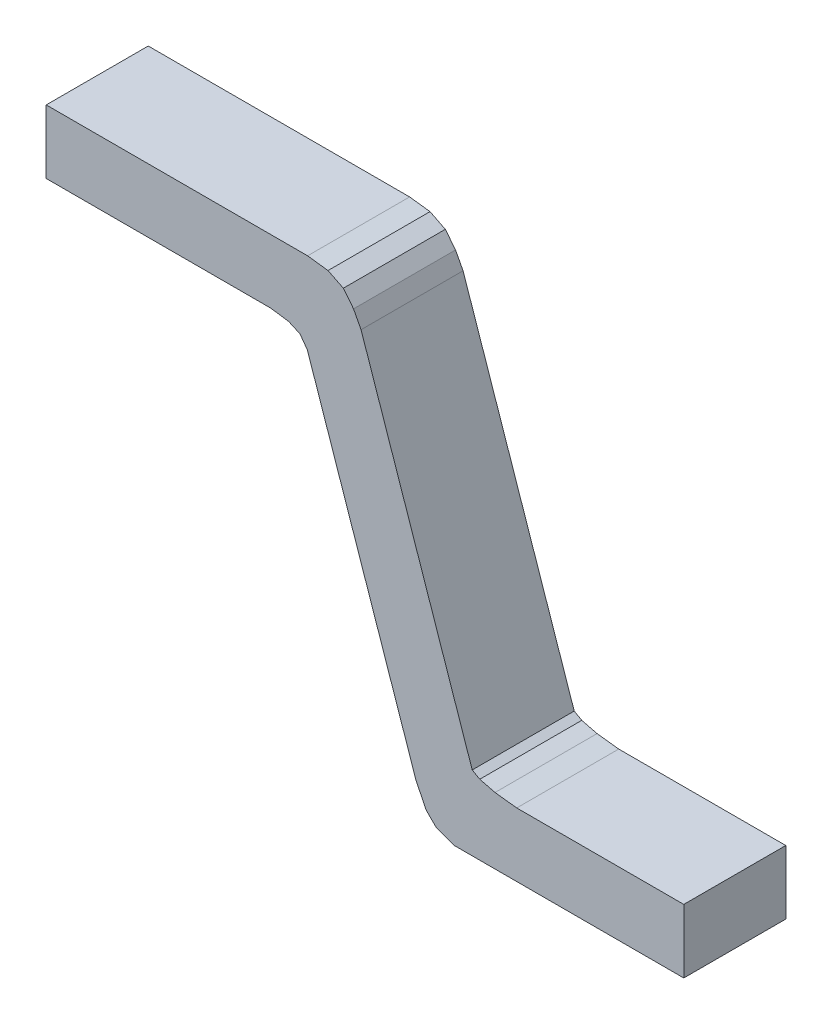
ISO-10303-21;
HEADER;
FILE_DESCRIPTION(('STEP AP214'),'2;1');
FILE_NAME('part.step','',(''),(''),'','','');
FILE_SCHEMA(('AUTOMOTIVE_DESIGN { 1 0 10303 214 1 1 1 1 }'));
ENDSEC;
DATA;
#1=APPLICATION_CONTEXT('core data for automotive mechanical design processes');
#2=APPLICATION_PROTOCOL_DEFINITION('international standard','automotive_design',2000,#1);
#3=PRODUCT_CONTEXT('',#1,'mechanical');
#4=PRODUCT('Part','Part','',(#3));
#5=PRODUCT_RELATED_PRODUCT_CATEGORY('part','',(#4));
#6=PRODUCT_DEFINITION_FORMATION('','',#4);
#7=PRODUCT_DEFINITION_CONTEXT('part definition',#1,'design');
#8=PRODUCT_DEFINITION('design','',#6,#7);
#9=PRODUCT_DEFINITION_SHAPE('','',#8);
#10=(LENGTH_UNIT() NAMED_UNIT(*) SI_UNIT(.MILLI.,.METRE.));
#11=(NAMED_UNIT(*) PLANE_ANGLE_UNIT() SI_UNIT($,.RADIAN.));
#12=(NAMED_UNIT(*) SI_UNIT($,.STERADIAN.) SOLID_ANGLE_UNIT());
#13=UNCERTAINTY_MEASURE_WITH_UNIT(LENGTH_MEASURE(1.E-05),#10,'distance_accuracy_value','');
#14=(GEOMETRIC_REPRESENTATION_CONTEXT(3) GLOBAL_UNCERTAINTY_ASSIGNED_CONTEXT((#13)) GLOBAL_UNIT_ASSIGNED_CONTEXT((#10,
#11,#12)) REPRESENTATION_CONTEXT('',''));
#15=CARTESIAN_POINT('',(0.,0.,0.));
#16=DIRECTION('',(0.,0.,1.));
#17=DIRECTION('',(1.,0.,0.));
#18=AXIS2_PLACEMENT_3D('',#15,#16,#17);
#19=CARTESIAN_POINT('',(2.50000008,-1.71500038,0.8));
#20=DIRECTION('',(0.,0.,1.));
#21=DIRECTION('',(1.,0.,0.));
#22=AXIS2_PLACEMENT_3D('',#19,#20,#21);
#23=PLANE('',#22);
#24=DIRECTION('',(0.440656785319311,-0.897675663896516,0.));
#25=VECTOR('',#24,1.);
#26=CARTESIAN_POINT('',(0.40003222,-1.42209774,0.8));
#27=LINE('',#26,#25);
#28=CARTESIAN_POINT('',(0.400032220000027,-1.42209774000001,0.8));
#29=VERTEX_POINT('',#28);
#30=CARTESIAN_POINT('',(0.47999904,-1.58500064,0.8));
#31=VERTEX_POINT('',#30);
#32=EDGE_CURVE('E157',#29,#31,#27,.T.);
#33=ORIENTED_EDGE('',*,*,#32,.T.);
#34=DIRECTION('',(0.707106781186547,-0.707106781186547,0.));
#35=VECTOR('',#34,1.);
#36=CARTESIAN_POINT('',(0.47999904,-1.58500064,0.8));
#37=LINE('',#36,#35);
#38=CARTESIAN_POINT('',(0.559998880000002,-1.66500048,0.8));
#39=VERTEX_POINT('',#38);
#40=EDGE_CURVE('E160',#31,#39,#37,.T.);
#41=ORIENTED_EDGE('',*,*,#40,.T.);
#42=DIRECTION('',(0.941743844344924,-0.336330985248821,0.));
#43=VECTOR('',#42,1.);
#44=CARTESIAN_POINT('',(0.55999888,-1.66500048,0.8));
#45=LINE('',#44,#43);
#46=CARTESIAN_POINT('',(0.70000114,-1.71500038,0.8));
#47=VERTEX_POINT('',#46);
#48=EDGE_CURVE('E20',#39,#47,#45,.T.);
#49=ORIENTED_EDGE('',*,*,#48,.T.);
#50=DIRECTION('',(1.,0.,0.));
#51=VECTOR('',#50,1.);
#52=CARTESIAN_POINT('',(2.50000008,-1.71500038,0.8));
#53=LINE('',#52,#51);
#54=CARTESIAN_POINT('',(2.50000008,-1.71500038,0.8));
#55=VERTEX_POINT('',#54);
#56=EDGE_CURVE('E163',#55,#47,#53,.F.);
#57=ORIENTED_EDGE('',*,*,#56,.F.);
#58=DIRECTION('',(0.,1.,0.));
#59=VECTOR('',#58,1.);
#60=CARTESIAN_POINT('',(2.50000008,-1.21500138,0.8));
#61=LINE('',#60,#59);
#62=CARTESIAN_POINT('',(2.50000008,-1.21500138,0.8));
#63=VERTEX_POINT('',#62);
#64=EDGE_CURVE('E178',#63,#55,#61,.F.);
#65=ORIENTED_EDGE('',*,*,#64,.F.);
#66=DIRECTION('',(1.,0.,0.));
#67=VECTOR('',#66,1.);
#68=CARTESIAN_POINT('',(1.19000016,-1.21500138,0.8));
#69=LINE('',#68,#67);
#70=CARTESIAN_POINT('',(1.19000016,-1.21500137999998,0.8));
#71=VERTEX_POINT('',#70);
#72=EDGE_CURVE('E183',#71,#63,#69,.T.);
#73=ORIENTED_EDGE('',*,*,#72,.F.);
#74=DIRECTION('',(-0.993150604322924,0.116841247566991,0.));
#75=VECTOR('',#74,1.);
#76=CARTESIAN_POINT('',(1.0200005,-1.19500142,0.8));
#77=LINE('',#76,#75);
#78=CARTESIAN_POINT('',(1.0200005,-1.19500141999999,0.8));
#79=VERTEX_POINT('',#78);
#80=EDGE_CURVE('E188',#79,#71,#77,.F.);
#81=ORIENTED_EDGE('',*,*,#80,.F.);
#82=DIRECTION('',(-0.970142500145391,0.242535625036098,0.));
#83=VECTOR('',#82,1.);
#84=CARTESIAN_POINT('',(0.90000074,-1.16500148,0.8));
#85=LINE('',#84,#83);
#86=CARTESIAN_POINT('',(0.90000074,-1.16500148,0.8));
#87=VERTEX_POINT('',#86);
#88=EDGE_CURVE('E193',#87,#79,#85,.F.);
#89=ORIENTED_EDGE('',*,*,#88,.F.);
#90=DIRECTION('',(-0.870381726372608,0.492377548631778,0.));
#91=VECTOR('',#90,1.);
#92=CARTESIAN_POINT('',(0.84087208,-1.13155222,0.8));
#93=LINE('',#92,#91);
#94=CARTESIAN_POINT('',(0.840872080000308,-1.1315522199999,0.8));
#95=VERTEX_POINT('',#94);
#96=EDGE_CURVE('E198',#95,#87,#93,.F.);
#97=ORIENTED_EDGE('',*,*,#96,.F.);
#98=DIRECTION('',(-0.323001701829079,0.946398383671231,0.));
#99=VECTOR('',#98,1.);
#100=CARTESIAN_POINT('',(-0.03091434000001,1.42279116,0.8));
#101=LINE('',#100,#99);
#102=CARTESIAN_POINT('',(-0.0309143400000312,1.42279116,0.8));
#103=VERTEX_POINT('',#102);
#104=EDGE_CURVE('E203',#103,#95,#101,.F.);
#105=ORIENTED_EDGE('',*,*,#104,.F.);
#106=DIRECTION('',(-0.465918127334981,0.884827835581965,0.));
#107=VECTOR('',#106,1.);
#108=CARTESIAN_POINT('',(-0.08999982,1.53500074,0.8));
#109=LINE('',#108,#107);
#110=CARTESIAN_POINT('',(-0.0899998200000124,1.53500074,0.8));
#111=VERTEX_POINT('',#110);
#112=EDGE_CURVE('E208',#111,#103,#109,.F.);
#113=ORIENTED_EDGE('',*,*,#112,.F.);
#114=DIRECTION('',(-0.62469504755418,0.780868809443225,0.));
#115=VECTOR('',#114,1.);
#116=CARTESIAN_POINT('',(-0.16999966,1.63500054,0.8));
#117=LINE('',#116,#115);
#118=CARTESIAN_POINT('',(-0.16999966,1.63500054,0.8));
#119=VERTEX_POINT('',#118);
#120=EDGE_CURVE('E213',#119,#111,#117,.F.);
#121=ORIENTED_EDGE('',*,*,#120,.F.);
#122=DIRECTION('',(-0.894427190999916,0.447213595499958,0.));
#123=VECTOR('',#122,1.);
#124=CARTESIAN_POINT('',(-0.28999942,1.69500042,0.8));
#125=LINE('',#124,#123);
#126=CARTESIAN_POINT('',(-0.289999419999999,1.69500042000001,0.8));
#127=VERTEX_POINT('',#126);
#128=EDGE_CURVE('E218',#127,#119,#125,.F.);
#129=ORIENTED_EDGE('',*,*,#128,.F.);
#130=DIRECTION('',(-0.992277876713698,0.124034734588962,0.));
#131=VECTOR('',#130,1.);
#132=CARTESIAN_POINT('',(-0.4499991,1.71500038,0.8));
#133=LINE('',#132,#131);
#134=CARTESIAN_POINT('',(-0.449999100000001,1.71500038,0.8));
#135=VERTEX_POINT('',#134);
#136=EDGE_CURVE('E223',#135,#127,#133,.F.);
#137=ORIENTED_EDGE('',*,*,#136,.F.);
#138=DIRECTION('',(1.,0.,0.));
#139=VECTOR('',#138,1.);
#140=CARTESIAN_POINT('',(-2.50000008,1.71500038,0.8));
#141=LINE('',#140,#139);
#142=CARTESIAN_POINT('',(-2.50000008,1.71500038,0.8));
#143=VERTEX_POINT('',#142);
#144=EDGE_CURVE('E228',#143,#135,#141,.T.);
#145=ORIENTED_EDGE('',*,*,#144,.F.);
#146=DIRECTION('',(0.,1.,0.));
#147=VECTOR('',#146,1.);
#148=CARTESIAN_POINT('',(-2.50000008,1.21499884,0.8));
#149=LINE('',#148,#147);
#150=CARTESIAN_POINT('',(-2.50000008,1.21499884,0.8));
#151=VERTEX_POINT('',#150);
#152=EDGE_CURVE('E233',#151,#143,#149,.T.);
#153=ORIENTED_EDGE('',*,*,#152,.F.);
#154=DIRECTION('',(1.,0.,0.));
#155=VECTOR('',#154,1.);
#156=CARTESIAN_POINT('',(-0.74000106,1.21499884,0.8));
#157=LINE('',#156,#155);
#158=CARTESIAN_POINT('',(-0.740001059999987,1.21499883999999,0.8));
#159=VERTEX_POINT('',#158);
#160=EDGE_CURVE('E238',#159,#151,#157,.F.);
#161=ORIENTED_EDGE('',*,*,#160,.F.);
#162=DIRECTION('',(0.989949493661207,-0.14142135623703,0.));
#163=VECTOR('',#162,1.);
#164=CARTESIAN_POINT('',(-0.60000134,1.19499888,0.8));
#165=LINE('',#164,#163);
#166=CARTESIAN_POINT('',(-0.600001340000002,1.19499887999999,0.8));
#167=VERTEX_POINT('',#166);
#168=EDGE_CURVE('E243',#167,#159,#165,.F.);
#169=ORIENTED_EDGE('',*,*,#168,.F.);
#170=DIRECTION('',(0.913815802464895,-0.406128894767953,0.));
#171=VECTOR('',#170,1.);
#172=CARTESIAN_POINT('',(-0.50999898,1.15499896,0.8));
#173=LINE('',#172,#171);
#174=CARTESIAN_POINT('',(-0.509998980000004,1.15499896,0.8));
#175=VERTEX_POINT('',#174);
#176=EDGE_CURVE('E248',#175,#167,#173,.F.);
#177=ORIENTED_EDGE('',*,*,#176,.F.);
#178=DIRECTION('',(0.586066820389869,-0.810262724082818,0.));
#179=VECTOR('',#178,1.);
#180=CARTESIAN_POINT('',(-0.45229272,1.07521756,0.8));
#181=LINE('',#180,#179);
#182=CARTESIAN_POINT('',(-0.45229271999988,1.07521756000004,0.8));
#183=VERTEX_POINT('',#182);
#184=EDGE_CURVE('E253',#183,#175,#181,.F.);
#185=ORIENTED_EDGE('',*,*,#184,.F.);
#186=DIRECTION('',(0.323002366654921,-0.946398156768767,0.));
#187=VECTOR('',#186,1.);
#188=CARTESIAN_POINT('',(0.40003222,-1.42209774,0.8));
#189=LINE('',#188,#187);
#190=EDGE_CURVE('E258',#29,#183,#189,.F.);
#191=ORIENTED_EDGE('',*,*,#190,.F.);
#192=EDGE_LOOP('',(#33,#41,#49,#57,#65,#73,#81,#89,#97,#105,#113,#121,#129,#137,#145,#153,#161,
#169,#177,#185,#191));
#193=FACE_BOUND('',#192,.T.);
#194=ADVANCED_FACE('F17',(#193),#23,.T.);
#195=CARTESIAN_POINT('',(2.50000008,-1.71500038,0.));
#196=DIRECTION('',(0.,-1.,0.));
#197=DIRECTION('',(0.,0.,-1.));
#198=AXIS2_PLACEMENT_3D('',#195,#196,#197);
#199=PLANE('',#198);
#200=DIRECTION('',(0.,0.,-1.));
#201=VECTOR('',#200,1.);
#202=CARTESIAN_POINT('',(2.50000008,-1.71500038,0.));
#203=LINE('',#202,#201);
#204=CARTESIAN_POINT('',(2.50000008,-1.71500038,0.));
#205=VERTEX_POINT('',#204);
#206=EDGE_CURVE('E176',#55,#205,#203,.T.);
#207=ORIENTED_EDGE('',*,*,#206,.F.);
#208=ORIENTED_EDGE('',*,*,#56,.T.);
#209=DIRECTION('',(0.,0.,1.));
#210=VECTOR('',#209,1.);
#211=CARTESIAN_POINT('',(0.70000114,-1.71500038,0.));
#212=LINE('',#211,#210);
#213=CARTESIAN_POINT('',(0.700001140000001,-1.71500038,0.));
#214=VERTEX_POINT('',#213);
#215=EDGE_CURVE('E168',#214,#47,#212,.T.);
#216=ORIENTED_EDGE('',*,*,#215,.F.);
#217=DIRECTION('',(1.,0.,0.));
#218=VECTOR('',#217,1.);
#219=CARTESIAN_POINT('',(2.50000008,-1.71500038,0.));
#220=LINE('',#219,#218);
#221=EDGE_CURVE('E265',#214,#205,#220,.T.);
#222=ORIENTED_EDGE('',*,*,#221,.T.);
#223=EDGE_LOOP('',(#207,#208,#216,#222));
#224=FACE_BOUND('',#223,.T.);
#225=ADVANCED_FACE('F397',(#224),#199,.T.);
#226=CARTESIAN_POINT('',(2.50000008,-1.21500138,0.));
#227=DIRECTION('',(1.,0.,0.));
#228=DIRECTION('',(0.,0.,-1.));
#229=AXIS2_PLACEMENT_3D('',#226,#227,#228);
#230=PLANE('',#229);
#231=DIRECTION('',(0.,0.,1.));
#232=VECTOR('',#231,1.);
#233=CARTESIAN_POINT('',(2.50000008,-1.21500138,0.));
#234=LINE('',#233,#232);
#235=CARTESIAN_POINT('',(2.50000008,-1.21500138,0.));
#236=VERTEX_POINT('',#235);
#237=EDGE_CURVE('E181',#63,#236,#234,.F.);
#238=ORIENTED_EDGE('',*,*,#237,.F.);
#239=ORIENTED_EDGE('',*,*,#64,.T.);
#240=ORIENTED_EDGE('',*,*,#206,.T.);
#241=DIRECTION('',(0.,1.,0.));
#242=VECTOR('',#241,1.);
#243=CARTESIAN_POINT('',(2.50000008,-1.71500038,0.));
#244=LINE('',#243,#242);
#245=EDGE_CURVE('E268',#205,#236,#244,.T.);
#246=ORIENTED_EDGE('',*,*,#245,.T.);
#247=EDGE_LOOP('',(#238,#239,#240,#246));
#248=FACE_BOUND('',#247,.T.);
#249=ADVANCED_FACE('F394',(#248),#230,.T.);
#250=CARTESIAN_POINT('',(1.19000016,-1.21500138,0.));
#251=DIRECTION('',(0.,1.,0.));
#252=DIRECTION('',(0.,0.,1.));
#253=AXIS2_PLACEMENT_3D('',#250,#251,#252);
#254=PLANE('',#253);
#255=DIRECTION('',(0.,0.,1.));
#256=VECTOR('',#255,1.);
#257=CARTESIAN_POINT('',(1.19000016000001,-1.21500137999993,0.));
#258=LINE('',#257,#256);
#259=CARTESIAN_POINT('',(1.19000016,-1.21500137999998,0.));
#260=VERTEX_POINT('',#259);
#261=EDGE_CURVE('E186',#71,#260,#258,.F.);
#262=ORIENTED_EDGE('',*,*,#261,.F.);
#263=ORIENTED_EDGE('',*,*,#72,.T.);
#264=ORIENTED_EDGE('',*,*,#237,.T.);
#265=DIRECTION('',(1.,0.,0.));
#266=VECTOR('',#265,1.);
#267=CARTESIAN_POINT('',(2.50000008,-1.21500138,0.));
#268=LINE('',#267,#266);
#269=EDGE_CURVE('E271',#236,#260,#268,.F.);
#270=ORIENTED_EDGE('',*,*,#269,.T.);
#271=EDGE_LOOP('',(#262,#263,#264,#270));
#272=FACE_BOUND('',#271,.T.);
#273=ADVANCED_FACE('F390',(#272),#254,.T.);
#274=CARTESIAN_POINT('',(1.0200005,-1.19500142,0.));
#275=DIRECTION('',(0.116841247566991,0.993150604322924,0.));
#276=DIRECTION('',(-0.993150604322924,0.116841247566991,0.));
#277=AXIS2_PLACEMENT_3D('',#274,#275,#276);
#278=PLANE('',#277);
#279=DIRECTION('',(0.,0.,1.));
#280=VECTOR('',#279,1.);
#281=CARTESIAN_POINT('',(1.02000050000001,-1.19500141999997,0.));
#282=LINE('',#281,#280);
#283=CARTESIAN_POINT('',(1.0200005,-1.19500141999999,0.));
#284=VERTEX_POINT('',#283);
#285=EDGE_CURVE('E191',#79,#284,#282,.F.);
#286=ORIENTED_EDGE('',*,*,#285,.F.);
#287=ORIENTED_EDGE('',*,*,#80,.T.);
#288=ORIENTED_EDGE('',*,*,#261,.T.);
#289=DIRECTION('',(-0.993150604322876,0.116841247567396,0.));
#290=VECTOR('',#289,1.);
#291=CARTESIAN_POINT('',(1.19000016,-1.21500138,0.));
#292=LINE('',#291,#290);
#293=EDGE_CURVE('E274',#260,#284,#292,.T.);
#294=ORIENTED_EDGE('',*,*,#293,.T.);
#295=EDGE_LOOP('',(#286,#287,#288,#294));
#296=FACE_BOUND('',#295,.T.);
#297=ADVANCED_FACE('F387',(#296),#278,.T.);
#298=CARTESIAN_POINT('',(0.90000074,-1.16500148,0.));
#299=DIRECTION('',(0.242535625036098,0.970142500145391,0.));
#300=DIRECTION('',(-0.970142500145391,0.242535625036098,0.));
#301=AXIS2_PLACEMENT_3D('',#298,#299,#300);
#302=PLANE('',#301);
#303=DIRECTION('',(0.,0.,1.));
#304=VECTOR('',#303,1.);
#305=CARTESIAN_POINT('',(0.900000740000002,-1.16500148,0.));
#306=LINE('',#305,#304);
#307=CARTESIAN_POINT('',(0.90000074,-1.16500148,0.));
#308=VERTEX_POINT('',#307);
#309=EDGE_CURVE('E196',#87,#308,#306,.F.);
#310=ORIENTED_EDGE('',*,*,#309,.F.);
#311=ORIENTED_EDGE('',*,*,#88,.T.);
#312=ORIENTED_EDGE('',*,*,#285,.T.);
#313=DIRECTION('',(-0.970142500145332,0.242535625036333,0.));
#314=VECTOR('',#313,1.);
#315=CARTESIAN_POINT('',(1.0200005,-1.19500142,0.));
#316=LINE('',#315,#314);
#317=EDGE_CURVE('E277',#284,#308,#316,.T.);
#318=ORIENTED_EDGE('',*,*,#317,.T.);
#319=EDGE_LOOP('',(#310,#311,#312,#318));
#320=FACE_BOUND('',#319,.T.);
#321=ADVANCED_FACE('F382',(#320),#302,.T.);
#322=CARTESIAN_POINT('',(0.84087208,-1.13155222,0.));
#323=DIRECTION('',(0.492377548631778,0.870381726372608,0.));
#324=DIRECTION('',(-0.870381726372608,0.492377548631778,0.));
#325=AXIS2_PLACEMENT_3D('',#322,#323,#324);
#326=PLANE('',#325);
#327=DIRECTION('',(0.,0.,1.));
#328=VECTOR('',#327,1.);
#329=CARTESIAN_POINT('',(0.840872080001234,-1.13155221999958,0.));
#330=LINE('',#329,#328);
#331=CARTESIAN_POINT('',(0.840872080000308,-1.1315522199999,0.));
#332=VERTEX_POINT('',#331);
#333=EDGE_CURVE('E201',#95,#332,#330,.F.);
#334=ORIENTED_EDGE('',*,*,#333,.F.);
#335=ORIENTED_EDGE('',*,*,#96,.T.);
#336=ORIENTED_EDGE('',*,*,#309,.T.);
#337=DIRECTION('',(-0.870381726372576,0.492377548631834,0.));
#338=VECTOR('',#337,1.);
#339=CARTESIAN_POINT('',(0.90000074,-1.16500148,0.));
#340=LINE('',#339,#338);
#341=EDGE_CURVE('E280',#308,#332,#340,.T.);
#342=ORIENTED_EDGE('',*,*,#341,.T.);
#343=EDGE_LOOP('',(#334,#335,#336,#342));
#344=FACE_BOUND('',#343,.T.);
#345=ADVANCED_FACE('F379',(#344),#326,.T.);
#346=CARTESIAN_POINT('',(-0.03091434000001,1.42279116,0.));
#347=DIRECTION('',(0.946398383671231,0.323001701829079,0.));
#348=DIRECTION('',(-0.323001701829079,0.946398383671231,0.));
#349=AXIS2_PLACEMENT_3D('',#346,#347,#348);
#350=PLANE('',#349);
#351=DIRECTION('',(0.,0.,1.));
#352=VECTOR('',#351,1.);
#353=CARTESIAN_POINT('',(-0.0309143400000743,1.42279115999998,0.));
#354=LINE('',#353,#352);
#355=CARTESIAN_POINT('',(-0.0309143400000312,1.42279116,0.));
#356=VERTEX_POINT('',#355);
#357=EDGE_CURVE('E206',#103,#356,#354,.F.);
#358=ORIENTED_EDGE('',*,*,#357,.F.);
#359=ORIENTED_EDGE('',*,*,#104,.T.);
#360=ORIENTED_EDGE('',*,*,#333,.T.);
#361=DIRECTION('',(-0.323001701828629,0.946398383671385,0.));
#362=VECTOR('',#361,1.);
#363=CARTESIAN_POINT('',(0.84087208,-1.13155222,0.));
#364=LINE('',#363,#362);
#365=EDGE_CURVE('E283',#332,#356,#364,.T.);
#366=ORIENTED_EDGE('',*,*,#365,.T.);
#367=EDGE_LOOP('',(#358,#359,#360,#366));
#368=FACE_BOUND('',#367,.T.);
#369=ADVANCED_FACE('F374',(#368),#350,.T.);
#370=CARTESIAN_POINT('',(-0.08999982,1.53500074,0.));
#371=DIRECTION('',(0.884827835581965,0.465918127334981,0.));
#372=DIRECTION('',(-0.465918127334981,0.884827835581965,0.));
#373=AXIS2_PLACEMENT_3D('',#370,#371,#372);
#374=PLANE('',#373);
#375=DIRECTION('',(0.,0.,1.));
#376=VECTOR('',#375,1.);
#377=CARTESIAN_POINT('',(-0.0899998200000351,1.53500073999998,0.));
#378=LINE('',#377,#376);
#379=CARTESIAN_POINT('',(-0.0899998200000124,1.53500074,0.));
#380=VERTEX_POINT('',#379);
#381=EDGE_CURVE('E211',#111,#380,#378,.F.);
#382=ORIENTED_EDGE('',*,*,#381,.F.);
#383=ORIENTED_EDGE('',*,*,#112,.T.);
#384=ORIENTED_EDGE('',*,*,#357,.T.);
#385=DIRECTION('',(-0.465918127335394,0.884827835581747,0.));
#386=VECTOR('',#385,1.);
#387=CARTESIAN_POINT('',(-0.0309143400000298,1.42279116,0.));
#388=LINE('',#387,#386);
#389=EDGE_CURVE('E286',#356,#380,#388,.T.);
#390=ORIENTED_EDGE('',*,*,#389,.T.);
#391=EDGE_LOOP('',(#382,#383,#384,#390));
#392=FACE_BOUND('',#391,.T.);
#393=ADVANCED_FACE('F371',(#392),#374,.T.);
#394=CARTESIAN_POINT('',(-0.16999966,1.63500054,0.));
#395=DIRECTION('',(0.780868809443225,0.62469504755418,0.));
#396=DIRECTION('',(-0.62469504755418,0.780868809443225,0.));
#397=AXIS2_PLACEMENT_3D('',#394,#395,#396);
#398=PLANE('',#397);
#399=DIRECTION('',(0.,0.,1.));
#400=VECTOR('',#399,1.);
#401=CARTESIAN_POINT('',(-0.16999966,1.63500054,0.));
#402=LINE('',#401,#400);
#403=CARTESIAN_POINT('',(-0.16999966,1.63500054,0.));
#404=VERTEX_POINT('',#403);
#405=EDGE_CURVE('E216',#119,#404,#402,.F.);
#406=ORIENTED_EDGE('',*,*,#405,.F.);
#407=ORIENTED_EDGE('',*,*,#120,.T.);
#408=ORIENTED_EDGE('',*,*,#381,.T.);
#409=DIRECTION('',(-0.624695047554376,0.780868809443069,0.));
#410=VECTOR('',#409,1.);
#411=CARTESIAN_POINT('',(-0.0899998200000101,1.53500074,0.));
#412=LINE('',#411,#410);
#413=EDGE_CURVE('E289',#380,#404,#412,.T.);
#414=ORIENTED_EDGE('',*,*,#413,.T.);
#415=EDGE_LOOP('',(#406,#407,#408,#414));
#416=FACE_BOUND('',#415,.T.);
#417=ADVANCED_FACE('F366',(#416),#398,.T.);
#418=CARTESIAN_POINT('',(-0.28999942,1.69500042,0.));
#419=DIRECTION('',(0.447213595499958,0.894427190999916,0.));
#420=DIRECTION('',(-0.894427190999916,0.447213595499958,0.));
#421=AXIS2_PLACEMENT_3D('',#418,#419,#420);
#422=PLANE('',#421);
#423=DIRECTION('',(0.,0.,1.));
#424=VECTOR('',#423,1.);
#425=CARTESIAN_POINT('',(-0.289999419999995,1.69500042000004,0.));
#426=LINE('',#425,#424);
#427=CARTESIAN_POINT('',(-0.289999419999999,1.69500042000001,0.));
#428=VERTEX_POINT('',#427);
#429=EDGE_CURVE('E221',#127,#428,#426,.F.);
#430=ORIENTED_EDGE('',*,*,#429,.F.);
#431=ORIENTED_EDGE('',*,*,#128,.T.);
#432=ORIENTED_EDGE('',*,*,#405,.T.);
#433=DIRECTION('',(-0.894427190999917,0.447213595499957,0.));
#434=VECTOR('',#433,1.);
#435=CARTESIAN_POINT('',(-0.16999966,1.63500054,0.));
#436=LINE('',#435,#434);
#437=EDGE_CURVE('E292',#404,#428,#436,.T.);
#438=ORIENTED_EDGE('',*,*,#437,.T.);
#439=EDGE_LOOP('',(#430,#431,#432,#438));
#440=FACE_BOUND('',#439,.T.);
#441=ADVANCED_FACE('F363',(#440),#422,.T.);
#442=CARTESIAN_POINT('',(-0.4499991,1.71500038,0.));
#443=DIRECTION('',(0.124034734588962,0.992277876713698,0.));
#444=DIRECTION('',(-0.992277876713698,0.124034734588962,0.));
#445=AXIS2_PLACEMENT_3D('',#442,#443,#444);
#446=PLANE('',#445);
#447=DIRECTION('',(0.,0.,1.));
#448=VECTOR('',#447,1.);
#449=CARTESIAN_POINT('',(-0.4499991,1.71500038,0.));
#450=LINE('',#449,#448);
#451=CARTESIAN_POINT('',(-0.449999100000001,1.71500038,0.));
#452=VERTEX_POINT('',#451);
#453=EDGE_CURVE('E226',#135,#452,#450,.F.);
#454=ORIENTED_EDGE('',*,*,#453,.F.);
#455=ORIENTED_EDGE('',*,*,#136,.T.);
#456=ORIENTED_EDGE('',*,*,#429,.T.);
#457=DIRECTION('',(-0.992277876713668,0.124034734589207,0.));
#458=VECTOR('',#457,1.);
#459=CARTESIAN_POINT('',(-0.28999942,1.69500042,0.));
#460=LINE('',#459,#458);
#461=EDGE_CURVE('E295',#428,#452,#460,.T.);
#462=ORIENTED_EDGE('',*,*,#461,.T.);
#463=EDGE_LOOP('',(#454,#455,#456,#462));
#464=FACE_BOUND('',#463,.T.);
#465=ADVANCED_FACE('F358',(#464),#446,.T.);
#466=CARTESIAN_POINT('',(-2.50000008,1.71500038,0.));
#467=DIRECTION('',(0.,1.,0.));
#468=DIRECTION('',(0.,0.,1.));
#469=AXIS2_PLACEMENT_3D('',#466,#467,#468);
#470=PLANE('',#469);
#471=DIRECTION('',(0.,0.,1.));
#472=VECTOR('',#471,1.);
#473=CARTESIAN_POINT('',(-2.50000008,1.71500038,0.));
#474=LINE('',#473,#472);
#475=CARTESIAN_POINT('',(-2.50000008,1.71500038,0.));
#476=VERTEX_POINT('',#475);
#477=EDGE_CURVE('E231',#143,#476,#474,.F.);
#478=ORIENTED_EDGE('',*,*,#477,.F.);
#479=ORIENTED_EDGE('',*,*,#144,.T.);
#480=ORIENTED_EDGE('',*,*,#453,.T.);
#481=DIRECTION('',(1.,0.,0.));
#482=VECTOR('',#481,1.);
#483=CARTESIAN_POINT('',(2.50000008,1.71500038,0.));
#484=LINE('',#483,#482);
#485=EDGE_CURVE('E298',#452,#476,#484,.F.);
#486=ORIENTED_EDGE('',*,*,#485,.T.);
#487=EDGE_LOOP('',(#478,#479,#480,#486));
#488=FACE_BOUND('',#487,.T.);
#489=ADVANCED_FACE('F355',(#488),#470,.T.);
#490=CARTESIAN_POINT('',(-2.50000008,1.21499884,0.));
#491=DIRECTION('',(-1.,0.,0.));
#492=DIRECTION('',(0.,0.,1.));
#493=AXIS2_PLACEMENT_3D('',#490,#491,#492);
#494=PLANE('',#493);
#495=DIRECTION('',(0.,0.,-1.));
#496=VECTOR('',#495,1.);
#497=CARTESIAN_POINT('',(-2.50000008,1.21499884,0.));
#498=LINE('',#497,#496);
#499=CARTESIAN_POINT('',(-2.50000008,1.21499884,0.));
#500=VERTEX_POINT('',#499);
#501=EDGE_CURVE('E236',#151,#500,#498,.T.);
#502=ORIENTED_EDGE('',*,*,#501,.F.);
#503=ORIENTED_EDGE('',*,*,#152,.T.);
#504=ORIENTED_EDGE('',*,*,#477,.T.);
#505=DIRECTION('',(0.,1.,0.));
#506=VECTOR('',#505,1.);
#507=CARTESIAN_POINT('',(-2.50000008,-1.71500038,0.));
#508=LINE('',#507,#506);
#509=EDGE_CURVE('E301',#476,#500,#508,.F.);
#510=ORIENTED_EDGE('',*,*,#509,.T.);
#511=EDGE_LOOP('',(#502,#503,#504,#510));
#512=FACE_BOUND('',#511,.T.);
#513=ADVANCED_FACE('F350',(#512),#494,.T.);
#514=CARTESIAN_POINT('',(-0.74000106,1.21499884,0.));
#515=DIRECTION('',(0.,-1.,0.));
#516=DIRECTION('',(0.,0.,-1.));
#517=AXIS2_PLACEMENT_3D('',#514,#515,#516);
#518=PLANE('',#517);
#519=DIRECTION('',(0.,0.,1.));
#520=VECTOR('',#519,1.);
#521=CARTESIAN_POINT('',(-0.740001060000006,1.21499883999996,0.));
#522=LINE('',#521,#520);
#523=CARTESIAN_POINT('',(-0.740001059999987,1.21499883999999,0.));
#524=VERTEX_POINT('',#523);
#525=EDGE_CURVE('E241',#159,#524,#522,.F.);
#526=ORIENTED_EDGE('',*,*,#525,.F.);
#527=ORIENTED_EDGE('',*,*,#160,.T.);
#528=ORIENTED_EDGE('',*,*,#501,.T.);
#529=DIRECTION('',(1.,0.,0.));
#530=VECTOR('',#529,1.);
#531=CARTESIAN_POINT('',(2.50000008,1.21499884,0.));
#532=LINE('',#531,#530);
#533=EDGE_CURVE('E304',#500,#524,#532,.T.);
#534=ORIENTED_EDGE('',*,*,#533,.T.);
#535=EDGE_LOOP('',(#526,#527,#528,#534));
#536=FACE_BOUND('',#535,.T.);
#537=ADVANCED_FACE('F347',(#536),#518,.T.);
#538=CARTESIAN_POINT('',(-0.60000134,1.19499888,0.));
#539=DIRECTION('',(-0.14142135623703,-0.989949493661207,0.));
#540=DIRECTION('',(0.989949493661207,-0.14142135623703,0.));
#541=AXIS2_PLACEMENT_3D('',#538,#539,#540);
#542=PLANE('',#541);
#543=DIRECTION('',(0.,0.,1.));
#544=VECTOR('',#543,1.);
#545=CARTESIAN_POINT('',(-0.60000134000001,1.19499887999998,0.));
#546=LINE('',#545,#544);
#547=CARTESIAN_POINT('',(-0.600001340000002,1.19499887999999,0.));
#548=VERTEX_POINT('',#547);
#549=EDGE_CURVE('E246',#167,#548,#546,.F.);
#550=ORIENTED_EDGE('',*,*,#549,.F.);
#551=ORIENTED_EDGE('',*,*,#168,.T.);
#552=ORIENTED_EDGE('',*,*,#525,.T.);
#553=DIRECTION('',(0.989949493661166,-0.141421356237311,0.));
#554=VECTOR('',#553,1.);
#555=CARTESIAN_POINT('',(-0.74000106,1.21499884,0.));
#556=LINE('',#555,#554);
#557=EDGE_CURVE('E307',#524,#548,#556,.T.);
#558=ORIENTED_EDGE('',*,*,#557,.T.);
#559=EDGE_LOOP('',(#550,#551,#552,#558));
#560=FACE_BOUND('',#559,.T.);
#561=ADVANCED_FACE('F342',(#560),#542,.T.);
#562=CARTESIAN_POINT('',(-0.50999898,1.15499896,0.));
#563=DIRECTION('',(-0.406128894767953,-0.913815802464895,0.));
#564=DIRECTION('',(0.913815802464895,-0.406128894767953,0.));
#565=AXIS2_PLACEMENT_3D('',#562,#563,#564);
#566=PLANE('',#565);
#567=DIRECTION('',(0.,0.,1.));
#568=VECTOR('',#567,1.);
#569=CARTESIAN_POINT('',(-0.509998980000017,1.15499895999999,0.));
#570=LINE('',#569,#568);
#571=CARTESIAN_POINT('',(-0.509998980000004,1.15499896,0.));
#572=VERTEX_POINT('',#571);
#573=EDGE_CURVE('E251',#175,#572,#570,.F.);
#574=ORIENTED_EDGE('',*,*,#573,.F.);
#575=ORIENTED_EDGE('',*,*,#176,.T.);
#576=ORIENTED_EDGE('',*,*,#549,.T.);
#577=DIRECTION('',(0.913815802464798,-0.406128894768172,0.));
#578=VECTOR('',#577,1.);
#579=CARTESIAN_POINT('',(-0.60000134,1.19499888,0.));
#580=LINE('',#579,#578);
#581=EDGE_CURVE('E310',#548,#572,#580,.T.);
#582=ORIENTED_EDGE('',*,*,#581,.T.);
#583=EDGE_LOOP('',(#574,#575,#576,#582));
#584=FACE_BOUND('',#583,.T.);
#585=ADVANCED_FACE('F339',(#584),#566,.T.);
#586=CARTESIAN_POINT('',(-0.45229272,1.07521756,0.));
#587=DIRECTION('',(-0.810262724082818,-0.586066820389869,0.));
#588=DIRECTION('',(0.586066820389869,-0.810262724082818,0.));
#589=AXIS2_PLACEMENT_3D('',#586,#587,#588);
#590=PLANE('',#589);
#591=DIRECTION('',(0.,0.,1.));
#592=VECTOR('',#591,1.);
#593=CARTESIAN_POINT('',(-0.45229271999952,1.07521756000016,0.));
#594=LINE('',#593,#592);
#595=CARTESIAN_POINT('',(-0.45229271999988,1.07521756000004,0.));
#596=VERTEX_POINT('',#595);
#597=EDGE_CURVE('E256',#183,#596,#594,.F.);
#598=ORIENTED_EDGE('',*,*,#597,.F.);
#599=ORIENTED_EDGE('',*,*,#184,.T.);
#600=ORIENTED_EDGE('',*,*,#573,.T.);
#601=DIRECTION('',(0.586066820389693,-0.810262724082945,0.));
#602=VECTOR('',#601,1.);
#603=CARTESIAN_POINT('',(-0.50999898,1.15499896,0.));
#604=LINE('',#603,#602);
#605=EDGE_CURVE('E313',#572,#596,#604,.T.);
#606=ORIENTED_EDGE('',*,*,#605,.T.);
#607=EDGE_LOOP('',(#598,#599,#600,#606));
#608=FACE_BOUND('',#607,.T.);
#609=ADVANCED_FACE('F334',(#608),#590,.T.);
#610=CARTESIAN_POINT('',(0.40003222,-1.42209774,0.));
#611=DIRECTION('',(-0.946398156768767,-0.323002366654921,0.));
#612=DIRECTION('',(0.323002366654921,-0.946398156768767,0.));
#613=AXIS2_PLACEMENT_3D('',#610,#611,#612);
#614=PLANE('',#613);
#615=DIRECTION('',(0.,0.,1.));
#616=VECTOR('',#615,1.);
#617=CARTESIAN_POINT('',(0.40003222000008,-1.42209773999996,0.));
#618=LINE('',#617,#616);
#619=CARTESIAN_POINT('',(0.400032220000023,-1.42209774,0.));
#620=VERTEX_POINT('',#619);
#621=EDGE_CURVE('E261',#29,#620,#618,.F.);
#622=ORIENTED_EDGE('',*,*,#621,.F.);
#623=ORIENTED_EDGE('',*,*,#190,.T.);
#624=ORIENTED_EDGE('',*,*,#597,.T.);
#625=DIRECTION('',(0.323002366655102,-0.946398156768705,0.));
#626=VECTOR('',#625,1.);
#627=CARTESIAN_POINT('',(-0.45229272,1.07521756,0.));
#628=LINE('',#627,#626);
#629=EDGE_CURVE('E316',#596,#620,#628,.T.);
#630=ORIENTED_EDGE('',*,*,#629,.T.);
#631=EDGE_LOOP('',(#622,#623,#624,#630));
#632=FACE_BOUND('',#631,.T.);
#633=ADVANCED_FACE('F331',(#632),#614,.T.);
#634=CARTESIAN_POINT('',(0.47999904,-1.58500064,0.));
#635=DIRECTION('',(-0.897675663896733,-0.440656785318869,0.));
#636=DIRECTION('',(0.440656785318869,-0.897675663896733,0.));
#637=AXIS2_PLACEMENT_3D('',#634,#635,#636);
#638=PLANE('',#637);
#639=DIRECTION('',(0.,0.,1.));
#640=VECTOR('',#639,1.);
#641=CARTESIAN_POINT('',(0.47999904,-1.58500064,0.));
#642=LINE('',#641,#640);
#643=CARTESIAN_POINT('',(0.47999904,-1.58500064,0.));
#644=VERTEX_POINT('',#643);
#645=EDGE_CURVE('E169',#31,#644,#642,.F.);
#646=ORIENTED_EDGE('',*,*,#645,.F.);
#647=ORIENTED_EDGE('',*,*,#32,.F.);
#648=ORIENTED_EDGE('',*,*,#621,.T.);
#649=DIRECTION('',(0.440656785319311,-0.897675663896516,0.));
#650=VECTOR('',#649,1.);
#651=CARTESIAN_POINT('',(0.40003222,-1.42209774,0.));
#652=LINE('',#651,#650);
#653=EDGE_CURVE('E319',#620,#644,#652,.T.);
#654=ORIENTED_EDGE('',*,*,#653,.T.);
#655=EDGE_LOOP('',(#646,#647,#648,#654));
#656=FACE_BOUND('',#655,.T.);
#657=ADVANCED_FACE('F324',(#656),#638,.T.);
#658=CARTESIAN_POINT('',(0.55999888,-1.66500048,0.));
#659=DIRECTION('',(-0.707106781186548,-0.707106781186548,0.));
#660=DIRECTION('',(0.707106781186548,-0.707106781186548,0.));
#661=AXIS2_PLACEMENT_3D('',#658,#659,#660);
#662=PLANE('',#661);
#663=DIRECTION('',(0.,0.,1.));
#664=VECTOR('',#663,1.);
#665=CARTESIAN_POINT('',(0.559998880000007,-1.66500047999998,0.));
#666=LINE('',#665,#664);
#667=CARTESIAN_POINT('',(0.559998880000002,-1.66500048,0.));
#668=VERTEX_POINT('',#667);
#669=EDGE_CURVE('E34',#39,#668,#666,.F.);
#670=ORIENTED_EDGE('',*,*,#669,.F.);
#671=ORIENTED_EDGE('',*,*,#40,.F.);
#672=ORIENTED_EDGE('',*,*,#645,.T.);
#673=DIRECTION('',(0.707106781186547,-0.707106781186547,0.));
#674=VECTOR('',#673,1.);
#675=CARTESIAN_POINT('',(0.47999904,-1.58500064,0.));
#676=LINE('',#675,#674);
#677=EDGE_CURVE('E26',#644,#668,#676,.T.);
#678=ORIENTED_EDGE('',*,*,#677,.T.);
#679=EDGE_LOOP('',(#670,#671,#672,#678));
#680=FACE_BOUND('',#679,.T.);
#681=ADVANCED_FACE('F166',(#680),#662,.T.);
#682=CARTESIAN_POINT('',(0.70000114,-1.71500038,0.));
#683=DIRECTION('',(-0.336330985248956,-0.941743844344876,0.));
#684=DIRECTION('',(0.941743844344876,-0.336330985248956,0.));
#685=AXIS2_PLACEMENT_3D('',#682,#683,#684);
#686=PLANE('',#685);
#687=ORIENTED_EDGE('',*,*,#215,.T.);
#688=ORIENTED_EDGE('',*,*,#48,.F.);
#689=ORIENTED_EDGE('',*,*,#669,.T.);
#690=DIRECTION('',(0.941743844344924,-0.336330985248821,0.));
#691=VECTOR('',#690,1.);
#692=CARTESIAN_POINT('',(0.55999888,-1.66500048,0.));
#693=LINE('',#692,#691);
#694=EDGE_CURVE('E11',#668,#214,#693,.T.);
#695=ORIENTED_EDGE('',*,*,#694,.T.);
#696=EDGE_LOOP('',(#687,#688,#689,#695));
#697=FACE_BOUND('',#696,.T.);
#698=ADVANCED_FACE('F172',(#697),#686,.T.);
#699=CARTESIAN_POINT('',(2.50000008,-1.71500038,0.));
#700=DIRECTION('',(0.,0.,1.));
#701=DIRECTION('',(1.,0.,0.));
#702=AXIS2_PLACEMENT_3D('',#699,#700,#701);
#703=PLANE('',#702);
#704=ORIENTED_EDGE('',*,*,#677,.F.);
#705=ORIENTED_EDGE('',*,*,#653,.F.);
#706=ORIENTED_EDGE('',*,*,#629,.F.);
#707=ORIENTED_EDGE('',*,*,#605,.F.);
#708=ORIENTED_EDGE('',*,*,#581,.F.);
#709=ORIENTED_EDGE('',*,*,#557,.F.);
#710=ORIENTED_EDGE('',*,*,#533,.F.);
#711=ORIENTED_EDGE('',*,*,#509,.F.);
#712=ORIENTED_EDGE('',*,*,#485,.F.);
#713=ORIENTED_EDGE('',*,*,#461,.F.);
#714=ORIENTED_EDGE('',*,*,#437,.F.);
#715=ORIENTED_EDGE('',*,*,#413,.F.);
#716=ORIENTED_EDGE('',*,*,#389,.F.);
#717=ORIENTED_EDGE('',*,*,#365,.F.);
#718=ORIENTED_EDGE('',*,*,#341,.F.);
#719=ORIENTED_EDGE('',*,*,#317,.F.);
#720=ORIENTED_EDGE('',*,*,#293,.F.);
#721=ORIENTED_EDGE('',*,*,#269,.F.);
#722=ORIENTED_EDGE('',*,*,#245,.F.);
#723=ORIENTED_EDGE('',*,*,#221,.F.);
#724=ORIENTED_EDGE('',*,*,#694,.F.);
#725=EDGE_LOOP('',(#704,#705,#706,#707,#708,#709,#710,#711,#712,#713,#714,#715,#716,#717,#718,
#719,#720,#721,#722,#723,#724));
#726=FACE_BOUND('',#725,.T.);
#727=ADVANCED_FACE('F328',(#726),#703,.F.);
#728=CLOSED_SHELL('',(#194,#225,#249,#273,#297,#321,#345,#369,#393,#417,#441,#465,#489,#513,
#537,#561,#585,#609,#633,#657,#681,#698,#727));
#729=MANIFOLD_SOLID_BREP('B1',#728);
#730=ADVANCED_BREP_SHAPE_REPRESENTATION('',(#18,#729),#14);
#731=SHAPE_DEFINITION_REPRESENTATION(#9,#730);
ENDSEC;
END-ISO-10303-21;
